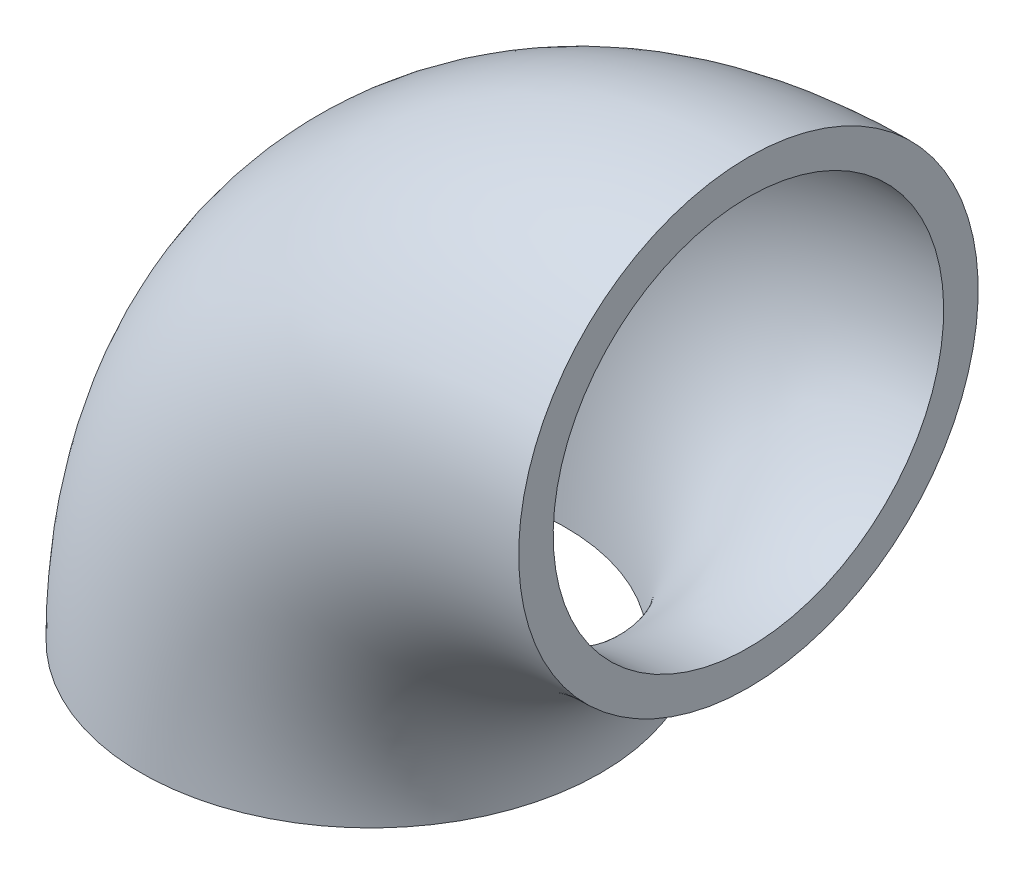
ISO-10303-21;
HEADER;
FILE_DESCRIPTION(('STEP AP214'),'2;1');
FILE_NAME('part.step','',(''),(''),'','','');
FILE_SCHEMA(('AUTOMOTIVE_DESIGN { 1 0 10303 214 1 1 1 1 }'));
ENDSEC;
DATA;
#1=APPLICATION_CONTEXT('core data for automotive mechanical design processes');
#2=APPLICATION_PROTOCOL_DEFINITION('international standard','automotive_design',2000,#1);
#3=PRODUCT_CONTEXT('',#1,'mechanical');
#4=PRODUCT('Part','Part','',(#3));
#5=PRODUCT_RELATED_PRODUCT_CATEGORY('part','',(#4));
#6=PRODUCT_DEFINITION_FORMATION('','',#4);
#7=PRODUCT_DEFINITION_CONTEXT('part definition',#1,'design');
#8=PRODUCT_DEFINITION('design','',#6,#7);
#9=PRODUCT_DEFINITION_SHAPE('','',#8);
#10=(LENGTH_UNIT() NAMED_UNIT(*) SI_UNIT(.MILLI.,.METRE.));
#11=(NAMED_UNIT(*) PLANE_ANGLE_UNIT() SI_UNIT($,.RADIAN.));
#12=(NAMED_UNIT(*) SI_UNIT($,.STERADIAN.) SOLID_ANGLE_UNIT());
#13=UNCERTAINTY_MEASURE_WITH_UNIT(LENGTH_MEASURE(1.E-05),#10,'distance_accuracy_value','');
#14=(GEOMETRIC_REPRESENTATION_CONTEXT(3) GLOBAL_UNCERTAINTY_ASSIGNED_CONTEXT((#13)) GLOBAL_UNIT_ASSIGNED_CONTEXT((#10,
#11,#12)) REPRESENTATION_CONTEXT('',''));
#15=CARTESIAN_POINT('',(0.,0.,0.));
#16=DIRECTION('',(0.,0.,1.));
#17=DIRECTION('',(1.,0.,0.));
#18=AXIS2_PLACEMENT_3D('',#15,#16,#17);
#19=CARTESIAN_POINT('',(0.,0.,0.));
#20=DIRECTION('',(0.,0.,1.));
#21=DIRECTION('',(1.,0.,0.));
#22=AXIS2_PLACEMENT_3D('',#19,#20,#21);
#23=TOROIDAL_SURFACE('',#22,17.5,10.65);
#24=CARTESIAN_POINT('',(0.,17.5,0.));
#25=DIRECTION('',(1.,0.,0.));
#26=DIRECTION('',(0.,0.,1.));
#27=AXIS2_PLACEMENT_3D('',#24,#25,#26);
#28=CIRCLE('',#27,10.65);
#29=CARTESIAN_POINT('',(0.,28.15,0.));
#30=VERTEX_POINT('',#29);
#31=EDGE_CURVE('E10',#30,#30,#28,.T.);
#32=CARTESIAN_POINT('',(-17.5,0.,0.));
#33=DIRECTION('',(0.,1.,0.));
#34=DIRECTION('',(0.,0.,1.));
#35=AXIS2_PLACEMENT_3D('',#32,#33,#34);
#36=CIRCLE('',#35,10.65);
#37=CARTESIAN_POINT('',(-28.15,0.,0.));
#38=VERTEX_POINT('',#37);
#39=EDGE_CURVE('E35',#38,#38,#36,.T.);
#40=CARTESIAN_POINT('',(0.,0.,0.));
#41=DIRECTION('',(0.,0.,1.));
#42=DIRECTION('',(1.,0.,0.));
#43=AXIS2_PLACEMENT_3D('',#40,#41,#42);
#44=CIRCLE('',#43,28.15);
#45=EDGE_CURVE('',#30,#38,#44,.T.);
#46=ORIENTED_EDGE('',*,*,#31,.F.);
#47=ORIENTED_EDGE('',*,*,#39,.T.);
#48=ORIENTED_EDGE('',*,*,#45,.T.);
#49=ORIENTED_EDGE('',*,*,#45,.F.);
#50=EDGE_LOOP('',(#46,#48,#47,#49));
#51=FACE_BOUND('',#50,.T.);
#52=ADVANCED_FACE('F29',(#51),#23,.T.);
#53=CARTESIAN_POINT('',(0.,17.5,0.));
#54=DIRECTION('',(1.,0.,0.));
#55=DIRECTION('',(0.,0.,1.));
#56=AXIS2_PLACEMENT_3D('',#53,#54,#55);
#57=PLANE('',#56);
#58=CARTESIAN_POINT('',(0.,17.5,0.));
#59=DIRECTION('',(1.,0.,0.));
#60=DIRECTION('',(0.,1.,0.));
#61=AXIS2_PLACEMENT_3D('',#58,#59,#60);
#62=CIRCLE('',#61,9.04999999999999);
#63=CARTESIAN_POINT('',(0.,26.55,0.));
#64=VERTEX_POINT('',#63);
#65=EDGE_CURVE('E39',#64,#64,#62,.T.);
#66=ORIENTED_EDGE('',*,*,#65,.F.);
#67=EDGE_LOOP('',(#66));
#68=FACE_BOUND('',#67,.T.);
#69=ORIENTED_EDGE('',*,*,#31,.T.);
#70=EDGE_LOOP('',(#69));
#71=FACE_BOUND('',#70,.T.);
#72=ADVANCED_FACE('F59',(#68,#71),#57,.T.);
#73=CARTESIAN_POINT('',(-17.5,0.,0.));
#74=DIRECTION('',(0.,1.,0.));
#75=DIRECTION('',(0.,0.,1.));
#76=AXIS2_PLACEMENT_3D('',#73,#74,#75);
#77=PLANE('',#76);
#78=CARTESIAN_POINT('',(-17.5,0.,0.));
#79=DIRECTION('',(0.,1.,0.));
#80=DIRECTION('',(0.,0.,1.));
#81=AXIS2_PLACEMENT_3D('',#78,#79,#80);
#82=CIRCLE('',#81,9.04999999999999);
#83=CARTESIAN_POINT('',(-26.55,0.,0.));
#84=VERTEX_POINT('',#83);
#85=EDGE_CURVE('E43',#84,#84,#82,.T.);
#86=ORIENTED_EDGE('',*,*,#85,.T.);
#87=EDGE_LOOP('',(#86));
#88=FACE_BOUND('',#87,.T.);
#89=ORIENTED_EDGE('',*,*,#39,.F.);
#90=EDGE_LOOP('',(#89));
#91=FACE_BOUND('',#90,.T.);
#92=ADVANCED_FACE('F49',(#88,#91),#77,.F.);
#93=CARTESIAN_POINT('',(0.,0.,0.));
#94=DIRECTION('',(0.,0.,1.));
#95=DIRECTION('',(1.,0.,0.));
#96=AXIS2_PLACEMENT_3D('',#93,#94,#95);
#97=TOROIDAL_SURFACE('',#96,17.5,9.04999999999999);
#98=CARTESIAN_POINT('',(0.,0.,0.));
#99=DIRECTION('',(0.,0.,1.));
#100=DIRECTION('',(1.,0.,0.));
#101=AXIS2_PLACEMENT_3D('',#98,#99,#100);
#102=CIRCLE('',#101,26.55);
#103=EDGE_CURVE('',#64,#84,#102,.T.);
#104=ORIENTED_EDGE('',*,*,#65,.T.);
#105=ORIENTED_EDGE('',*,*,#85,.F.);
#106=ORIENTED_EDGE('',*,*,#103,.T.);
#107=ORIENTED_EDGE('',*,*,#103,.F.);
#108=EDGE_LOOP('',(#104,#106,#105,#107));
#109=FACE_BOUND('',#108,.T.);
#110=ADVANCED_FACE('F52',(#109),#97,.F.);
#111=CLOSED_SHELL('',(#52,#72,#92,#110));
#112=MANIFOLD_SOLID_BREP('B2',#111);
#113=ADVANCED_BREP_SHAPE_REPRESENTATION('',(#18,#112),#14);
#114=SHAPE_DEFINITION_REPRESENTATION(#9,#113);
ENDSEC;
END-ISO-10303-21;
